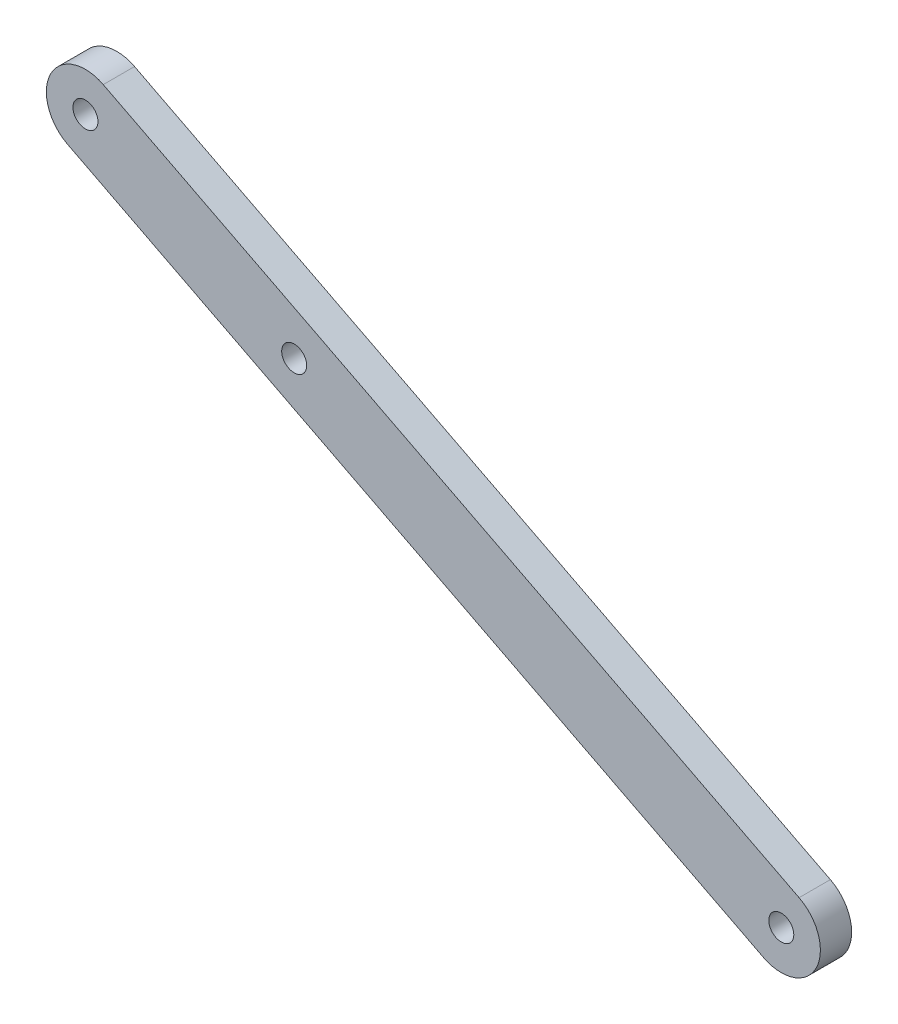
ISO-10303-21;
HEADER;
FILE_DESCRIPTION(('STEP AP214'),'2;1');
FILE_NAME('part.step','',(''),(''),'','','');
FILE_SCHEMA(('AUTOMOTIVE_DESIGN { 1 0 10303 214 1 1 1 1 }'));
ENDSEC;
DATA;
#1=APPLICATION_CONTEXT('core data for automotive mechanical design processes');
#2=APPLICATION_PROTOCOL_DEFINITION('international standard','automotive_design',2000,#1);
#3=PRODUCT_CONTEXT('',#1,'mechanical');
#4=PRODUCT('Part','Part','',(#3));
#5=PRODUCT_RELATED_PRODUCT_CATEGORY('part','',(#4));
#6=PRODUCT_DEFINITION_FORMATION('','',#4);
#7=PRODUCT_DEFINITION_CONTEXT('part definition',#1,'design');
#8=PRODUCT_DEFINITION('design','',#6,#7);
#9=PRODUCT_DEFINITION_SHAPE('','',#8);
#10=(LENGTH_UNIT() NAMED_UNIT(*) SI_UNIT(.MILLI.,.METRE.));
#11=(NAMED_UNIT(*) PLANE_ANGLE_UNIT() SI_UNIT($,.RADIAN.));
#12=(NAMED_UNIT(*) SI_UNIT($,.STERADIAN.) SOLID_ANGLE_UNIT());
#13=UNCERTAINTY_MEASURE_WITH_UNIT(LENGTH_MEASURE(1.E-05),#10,'distance_accuracy_value','');
#14=(GEOMETRIC_REPRESENTATION_CONTEXT(3) GLOBAL_UNCERTAINTY_ASSIGNED_CONTEXT((#13)) GLOBAL_UNIT_ASSIGNED_CONTEXT((#10,
#11,#12)) REPRESENTATION_CONTEXT('',''));
#15=CARTESIAN_POINT('',(0.,0.,0.));
#16=DIRECTION('',(0.,0.,1.));
#17=DIRECTION('',(1.,0.,0.));
#18=AXIS2_PLACEMENT_3D('',#15,#16,#17);
#19=CARTESIAN_POINT('',(0.,0.,4.));
#20=DIRECTION('',(0.,0.,1.));
#21=DIRECTION('',(1.,0.,0.));
#22=AXIS2_PLACEMENT_3D('',#19,#20,#21);
#23=PLANE('',#22);
#24=CARTESIAN_POINT('',(0.,0.,4.));
#25=DIRECTION('',(0.,0.,1.));
#26=DIRECTION('',(1.,0.,0.));
#27=AXIS2_PLACEMENT_3D('',#24,#25,#26);
#28=CIRCLE('',#27,1.6);
#29=CARTESIAN_POINT('',(1.60000000000001,0.,4.));
#30=VERTEX_POINT('',#29);
#31=EDGE_CURVE('E134',#30,#30,#28,.T.);
#32=ORIENTED_EDGE('',*,*,#31,.F.);
#33=EDGE_LOOP('',(#32));
#34=FACE_BOUND('',#33,.T.);
#35=CARTESIAN_POINT('',(0.,0.,4.));
#36=DIRECTION('',(0.,0.,1.));
#37=DIRECTION('',(1.,0.,0.));
#38=AXIS2_PLACEMENT_3D('',#35,#36,#37);
#39=CIRCLE('',#38,5.);
#40=CARTESIAN_POINT('',(-2.27846198612919,-4.45068657375064,4.));
#41=VERTEX_POINT('',#40);
#42=CARTESIAN_POINT('',(2.2784619861292,4.45068657375064,4.));
#43=VERTEX_POINT('',#42);
#44=EDGE_CURVE('E92',#41,#43,#39,.T.);
#45=ORIENTED_EDGE('',*,*,#44,.T.);
#46=DIRECTION('',(-0.890137314750128,0.455692397225839,0.));
#47=VECTOR('',#46,1.);
#48=CARTESIAN_POINT('',(2.2784619861292,4.45068657375064,4.));
#49=LINE('',#48,#47);
#50=CARTESIAN_POINT('',(-86.7352694888836,50.0199262963345,4.));
#51=VERTEX_POINT('',#50);
#52=EDGE_CURVE('E87',#43,#51,#49,.T.);
#53=ORIENTED_EDGE('',*,*,#52,.T.);
#54=CARTESIAN_POINT('',(-89.0137314750128,45.5692397225839,4.));
#55=DIRECTION('',(0.,0.,1.));
#56=DIRECTION('',(1.,0.,0.));
#57=AXIS2_PLACEMENT_3D('',#54,#55,#56);
#58=CIRCLE('',#57,5.00000000000001);
#59=CARTESIAN_POINT('',(-91.292193461142,41.1185531488332,4.));
#60=VERTEX_POINT('',#59);
#61=EDGE_CURVE('E90',#51,#60,#58,.T.);
#62=ORIENTED_EDGE('',*,*,#61,.T.);
#63=DIRECTION('',(0.890137314750128,-0.455692397225839,0.));
#64=VECTOR('',#63,1.);
#65=CARTESIAN_POINT('',(-2.27846198612919,-4.45068657375064,4.));
#66=LINE('',#65,#64);
#67=EDGE_CURVE('E57',#60,#41,#66,.T.);
#68=ORIENTED_EDGE('',*,*,#67,.T.);
#69=EDGE_LOOP('',(#45,#53,#62,#68));
#70=FACE_BOUND('',#69,.T.);
#71=CARTESIAN_POINT('',(-89.0137314750128,45.5692397225839,4.));
#72=DIRECTION('',(0.,0.,1.));
#73=DIRECTION('',(1.,0.,0.));
#74=AXIS2_PLACEMENT_3D('',#71,#72,#73);
#75=CIRCLE('',#74,1.60000000000001);
#76=CARTESIAN_POINT('',(-87.4137314750128,45.5692397225839,4.));
#77=VERTEX_POINT('',#76);
#78=EDGE_CURVE('E112',#77,#77,#75,.T.);
#79=ORIENTED_EDGE('',*,*,#78,.F.);
#80=EDGE_LOOP('',(#79));
#81=FACE_BOUND('',#80,.T.);
#82=CARTESIAN_POINT('',(-62.309612032509,31.8984678058087,4.));
#83=DIRECTION('',(0.,0.,1.));
#84=DIRECTION('',(1.,0.,0.));
#85=AXIS2_PLACEMENT_3D('',#82,#83,#84);
#86=CIRCLE('',#85,1.60000000000001);
#87=CARTESIAN_POINT('',(-60.709612032509,31.8984678058087,4.));
#88=VERTEX_POINT('',#87);
#89=EDGE_CURVE('E142',#88,#88,#86,.T.);
#90=ORIENTED_EDGE('',*,*,#89,.F.);
#91=EDGE_LOOP('',(#90));
#92=FACE_BOUND('',#91,.T.);
#93=ADVANCED_FACE('F39',(#34,#70,#81,#92),#23,.T.);
#94=CARTESIAN_POINT('',(0.,0.,0.));
#95=DIRECTION('',(0.,0.,1.));
#96=DIRECTION('',(1.,0.,0.));
#97=AXIS2_PLACEMENT_3D('',#94,#95,#96);
#98=PLANE('',#97);
#99=CARTESIAN_POINT('',(0.,0.,0.));
#100=DIRECTION('',(0.,0.,1.));
#101=DIRECTION('',(1.,0.,0.));
#102=AXIS2_PLACEMENT_3D('',#99,#100,#101);
#103=CIRCLE('',#102,5.);
#104=CARTESIAN_POINT('',(-2.27846198612919,-4.45068657375064,0.));
#105=VERTEX_POINT('',#104);
#106=CARTESIAN_POINT('',(2.2784619861292,4.45068657375064,0.));
#107=VERTEX_POINT('',#106);
#108=EDGE_CURVE('E108',#105,#107,#103,.T.);
#109=ORIENTED_EDGE('',*,*,#108,.F.);
#110=DIRECTION('',(0.890137314750128,-0.455692397225839,0.));
#111=VECTOR('',#110,1.);
#112=CARTESIAN_POINT('',(-2.27846198612919,-4.45068657375064,0.));
#113=LINE('',#112,#111);
#114=CARTESIAN_POINT('',(-91.292193461142,41.1185531488332,0.));
#115=VERTEX_POINT('',#114);
#116=EDGE_CURVE('E80',#115,#105,#113,.T.);
#117=ORIENTED_EDGE('',*,*,#116,.F.);
#118=CARTESIAN_POINT('',(-89.0137314750128,45.5692397225839,0.));
#119=DIRECTION('',(0.,0.,1.));
#120=DIRECTION('',(1.,0.,0.));
#121=AXIS2_PLACEMENT_3D('',#118,#119,#120);
#122=CIRCLE('',#121,5.00000000000001);
#123=CARTESIAN_POINT('',(-86.7352694888836,50.0199262963345,0.));
#124=VERTEX_POINT('',#123);
#125=EDGE_CURVE('E74',#124,#115,#122,.T.);
#126=ORIENTED_EDGE('',*,*,#125,.F.);
#127=DIRECTION('',(-0.890137314750128,0.455692397225839,0.));
#128=VECTOR('',#127,1.);
#129=CARTESIAN_POINT('',(2.2784619861292,4.45068657375064,0.));
#130=LINE('',#129,#128);
#131=EDGE_CURVE('E97',#107,#124,#130,.T.);
#132=ORIENTED_EDGE('',*,*,#131,.F.);
#133=EDGE_LOOP('',(#109,#117,#126,#132));
#134=FACE_BOUND('',#133,.T.);
#135=CARTESIAN_POINT('',(-89.0137314750128,45.5692397225839,0.));
#136=DIRECTION('',(0.,0.,1.));
#137=DIRECTION('',(1.,0.,0.));
#138=AXIS2_PLACEMENT_3D('',#135,#136,#137);
#139=CIRCLE('',#138,1.60000000000001);
#140=CARTESIAN_POINT('',(-87.4137314750128,45.5692397225839,0.));
#141=VERTEX_POINT('',#140);
#142=EDGE_CURVE('E130',#141,#141,#139,.T.);
#143=ORIENTED_EDGE('',*,*,#142,.T.);
#144=EDGE_LOOP('',(#143));
#145=FACE_BOUND('',#144,.T.);
#146=CARTESIAN_POINT('',(0.,0.,0.));
#147=DIRECTION('',(0.,0.,1.));
#148=DIRECTION('',(1.,0.,0.));
#149=AXIS2_PLACEMENT_3D('',#146,#147,#148);
#150=CIRCLE('',#149,1.6);
#151=CARTESIAN_POINT('',(1.60000000000001,0.,0.));
#152=VERTEX_POINT('',#151);
#153=EDGE_CURVE('E138',#152,#152,#150,.T.);
#154=ORIENTED_EDGE('',*,*,#153,.T.);
#155=EDGE_LOOP('',(#154));
#156=FACE_BOUND('',#155,.T.);
#157=CARTESIAN_POINT('',(-62.309612032509,31.8984678058087,0.));
#158=DIRECTION('',(0.,0.,1.));
#159=DIRECTION('',(1.,0.,0.));
#160=AXIS2_PLACEMENT_3D('',#157,#158,#159);
#161=CIRCLE('',#160,1.60000000000001);
#162=CARTESIAN_POINT('',(-60.709612032509,31.8984678058087,0.));
#163=VERTEX_POINT('',#162);
#164=EDGE_CURVE('E146',#163,#163,#161,.T.);
#165=ORIENTED_EDGE('',*,*,#164,.T.);
#166=EDGE_LOOP('',(#165));
#167=FACE_BOUND('',#166,.T.);
#168=ADVANCED_FACE('F125',(#134,#145,#156,#167),#98,.F.);
#169=CARTESIAN_POINT('',(0.,0.,4.));
#170=DIRECTION('',(0.,0.,-1.));
#171=DIRECTION('',(-1.,0.,0.));
#172=AXIS2_PLACEMENT_3D('',#169,#170,#171);
#173=CYLINDRICAL_SURFACE('',#172,5.);
#174=ORIENTED_EDGE('',*,*,#108,.T.);
#175=DIRECTION('',(0.,0.,-1.));
#176=VECTOR('',#175,1.);
#177=CARTESIAN_POINT('',(2.2784619861292,4.45068657375064,4.));
#178=LINE('',#177,#176);
#179=EDGE_CURVE('E11',#43,#107,#178,.T.);
#180=ORIENTED_EDGE('',*,*,#179,.F.);
#181=ORIENTED_EDGE('',*,*,#44,.F.);
#182=DIRECTION('',(0.,0.,-1.));
#183=VECTOR('',#182,1.);
#184=CARTESIAN_POINT('',(-2.27846198612919,-4.45068657375064,4.));
#185=LINE('',#184,#183);
#186=EDGE_CURVE('E104',#41,#105,#185,.T.);
#187=ORIENTED_EDGE('',*,*,#186,.T.);
#188=EDGE_LOOP('',(#174,#180,#181,#187));
#189=FACE_BOUND('',#188,.T.);
#190=ADVANCED_FACE('F41',(#189),#173,.T.);
#191=CARTESIAN_POINT('',(2.2784619861292,4.45068657375064,4.));
#192=DIRECTION('',(-0.455692397225839,-0.890137314750128,0.));
#193=DIRECTION('',(0.890137314750128,-0.455692397225839,0.));
#194=AXIS2_PLACEMENT_3D('',#191,#192,#193);
#195=PLANE('',#194);
#196=ORIENTED_EDGE('',*,*,#131,.T.);
#197=DIRECTION('',(0.,0.,-1.));
#198=VECTOR('',#197,1.);
#199=CARTESIAN_POINT('',(-86.7352694888836,50.0199262963345,4.));
#200=LINE('',#199,#198);
#201=EDGE_CURVE('E49',#51,#124,#200,.T.);
#202=ORIENTED_EDGE('',*,*,#201,.F.);
#203=ORIENTED_EDGE('',*,*,#52,.F.);
#204=ORIENTED_EDGE('',*,*,#179,.T.);
#205=EDGE_LOOP('',(#196,#202,#203,#204));
#206=FACE_BOUND('',#205,.T.);
#207=ADVANCED_FACE('F96',(#206),#195,.F.);
#208=CARTESIAN_POINT('',(-89.0137314750128,45.5692397225839,4.));
#209=DIRECTION('',(0.,0.,-1.));
#210=DIRECTION('',(-1.,0.,0.));
#211=AXIS2_PLACEMENT_3D('',#208,#209,#210);
#212=CYLINDRICAL_SURFACE('',#211,5.00000000000001);
#213=ORIENTED_EDGE('',*,*,#125,.T.);
#214=DIRECTION('',(0.,0.,-1.));
#215=VECTOR('',#214,1.);
#216=CARTESIAN_POINT('',(-91.292193461142,41.1185531488332,4.));
#217=LINE('',#216,#215);
#218=EDGE_CURVE('E99',#60,#115,#217,.T.);
#219=ORIENTED_EDGE('',*,*,#218,.F.);
#220=ORIENTED_EDGE('',*,*,#61,.F.);
#221=ORIENTED_EDGE('',*,*,#201,.T.);
#222=EDGE_LOOP('',(#213,#219,#220,#221));
#223=FACE_BOUND('',#222,.T.);
#224=ADVANCED_FACE('F100',(#223),#212,.T.);
#225=CARTESIAN_POINT('',(-2.27846198612919,-4.45068657375064,4.));
#226=DIRECTION('',(0.455692397225839,0.890137314750128,0.));
#227=DIRECTION('',(-0.890137314750128,0.455692397225839,0.));
#228=AXIS2_PLACEMENT_3D('',#225,#226,#227);
#229=PLANE('',#228);
#230=ORIENTED_EDGE('',*,*,#116,.T.);
#231=ORIENTED_EDGE('',*,*,#186,.F.);
#232=ORIENTED_EDGE('',*,*,#67,.F.);
#233=ORIENTED_EDGE('',*,*,#218,.T.);
#234=EDGE_LOOP('',(#230,#231,#232,#233));
#235=FACE_BOUND('',#234,.T.);
#236=ADVANCED_FACE('F122',(#235),#229,.F.);
#237=CARTESIAN_POINT('',(-89.0137314750128,45.5692397225839,4.));
#238=DIRECTION('',(0.,0.,-1.));
#239=DIRECTION('',(-1.,0.,0.));
#240=AXIS2_PLACEMENT_3D('',#237,#238,#239);
#241=CYLINDRICAL_SURFACE('',#240,1.60000000000001);
#242=ORIENTED_EDGE('',*,*,#78,.T.);
#243=EDGE_LOOP('',(#242));
#244=FACE_BOUND('',#243,.T.);
#245=ORIENTED_EDGE('',*,*,#142,.F.);
#246=EDGE_LOOP('',(#245));
#247=FACE_BOUND('',#246,.T.);
#248=ADVANCED_FACE('F166',(#244,#247),#241,.F.);
#249=CARTESIAN_POINT('',(0.,0.,4.));
#250=DIRECTION('',(0.,0.,-1.));
#251=DIRECTION('',(-1.,0.,0.));
#252=AXIS2_PLACEMENT_3D('',#249,#250,#251);
#253=CYLINDRICAL_SURFACE('',#252,1.6);
#254=ORIENTED_EDGE('',*,*,#31,.T.);
#255=EDGE_LOOP('',(#254));
#256=FACE_BOUND('',#255,.T.);
#257=ORIENTED_EDGE('',*,*,#153,.F.);
#258=EDGE_LOOP('',(#257));
#259=FACE_BOUND('',#258,.T.);
#260=ADVANCED_FACE('F212',(#256,#259),#253,.F.);
#261=CARTESIAN_POINT('',(-62.309612032509,31.8984678058087,4.));
#262=DIRECTION('',(0.,0.,-1.));
#263=DIRECTION('',(-1.,0.,0.));
#264=AXIS2_PLACEMENT_3D('',#261,#262,#263);
#265=CYLINDRICAL_SURFACE('',#264,1.60000000000001);
#266=ORIENTED_EDGE('',*,*,#89,.T.);
#267=EDGE_LOOP('',(#266));
#268=FACE_BOUND('',#267,.T.);
#269=ORIENTED_EDGE('',*,*,#164,.F.);
#270=EDGE_LOOP('',(#269));
#271=FACE_BOUND('',#270,.T.);
#272=ADVANCED_FACE('F154',(#268,#271),#265,.F.);
#273=CLOSED_SHELL('',(#93,#168,#190,#207,#224,#236,#248,#260,#272));
#274=MANIFOLD_SOLID_BREP('B2',#273);
#275=ADVANCED_BREP_SHAPE_REPRESENTATION('',(#18,#274),#14);
#276=SHAPE_DEFINITION_REPRESENTATION(#9,#275);
ENDSEC;
END-ISO-10303-21;
